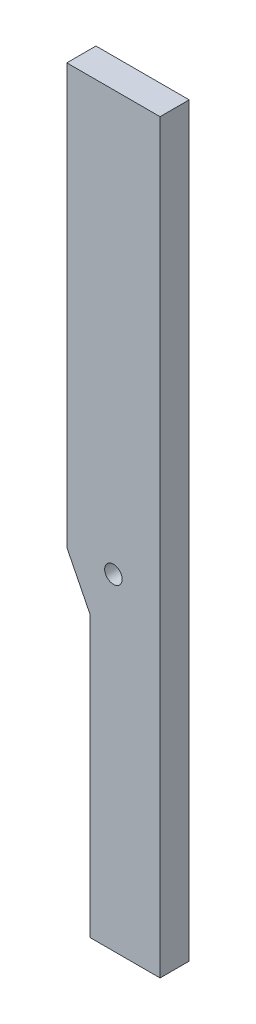
ISO-10303-21;
HEADER;
FILE_DESCRIPTION(('STEP AP214'),'2;1');
FILE_NAME('part.step','',(''),(''),'','','');
FILE_SCHEMA(('AUTOMOTIVE_DESIGN { 1 0 10303 214 1 1 1 1 }'));
ENDSEC;
DATA;
#1=APPLICATION_CONTEXT('core data for automotive mechanical design processes');
#2=APPLICATION_PROTOCOL_DEFINITION('international standard','automotive_design',2000,#1);
#3=PRODUCT_CONTEXT('',#1,'mechanical');
#4=PRODUCT('Part','Part','',(#3));
#5=PRODUCT_RELATED_PRODUCT_CATEGORY('part','',(#4));
#6=PRODUCT_DEFINITION_FORMATION('','',#4);
#7=PRODUCT_DEFINITION_CONTEXT('part definition',#1,'design');
#8=PRODUCT_DEFINITION('design','',#6,#7);
#9=PRODUCT_DEFINITION_SHAPE('','',#8);
#10=(LENGTH_UNIT() NAMED_UNIT(*) SI_UNIT(.MILLI.,.METRE.));
#11=(NAMED_UNIT(*) PLANE_ANGLE_UNIT() SI_UNIT($,.RADIAN.));
#12=(NAMED_UNIT(*) SI_UNIT($,.STERADIAN.) SOLID_ANGLE_UNIT());
#13=UNCERTAINTY_MEASURE_WITH_UNIT(LENGTH_MEASURE(1.E-05),#10,'distance_accuracy_value','');
#14=(GEOMETRIC_REPRESENTATION_CONTEXT(3) GLOBAL_UNCERTAINTY_ASSIGNED_CONTEXT((#13)) GLOBAL_UNIT_ASSIGNED_CONTEXT((#10,
#11,#12)) REPRESENTATION_CONTEXT('',''));
#15=CARTESIAN_POINT('',(0.,0.,0.));
#16=DIRECTION('',(0.,0.,1.));
#17=DIRECTION('',(1.,0.,0.));
#18=AXIS2_PLACEMENT_3D('',#15,#16,#17);
#19=CARTESIAN_POINT('',(0.,0.,15.875));
#20=DIRECTION('',(1.,0.,0.));
#21=DIRECTION('',(0.,0.,-1.));
#22=AXIS2_PLACEMENT_3D('',#19,#20,#21);
#23=PLANE('',#22);
#24=DIRECTION('',(0.,-1.,0.));
#25=VECTOR('',#24,1.);
#26=CARTESIAN_POINT('',(0.,0.,0.));
#27=LINE('',#26,#25);
#28=CARTESIAN_POINT('',(0.,254.,0.));
#29=VERTEX_POINT('',#28);
#30=CARTESIAN_POINT('',(0.,25.4000000000001,0.));
#31=VERTEX_POINT('',#30);
#32=EDGE_CURVE('E118',#29,#31,#27,.T.);
#33=ORIENTED_EDGE('',*,*,#32,.T.);
#34=DIRECTION('',(0.,0.,1.));
#35=VECTOR('',#34,1.);
#36=CARTESIAN_POINT('',(0.,25.4000000000001,15.875));
#37=LINE('',#36,#35);
#38=CARTESIAN_POINT('',(0.,25.4000000000001,15.875));
#39=VERTEX_POINT('',#38);
#40=EDGE_CURVE('E40',#31,#39,#37,.T.);
#41=ORIENTED_EDGE('',*,*,#40,.T.);
#42=DIRECTION('',(0.,-1.,0.));
#43=VECTOR('',#42,1.);
#44=CARTESIAN_POINT('',(0.,0.,15.875));
#45=LINE('',#44,#43);
#46=CARTESIAN_POINT('',(0.,254.,15.875));
#47=VERTEX_POINT('',#46);
#48=EDGE_CURVE('E121',#47,#39,#45,.T.);
#49=ORIENTED_EDGE('',*,*,#48,.F.);
#50=DIRECTION('',(0.,0.,-1.));
#51=VECTOR('',#50,1.);
#52=CARTESIAN_POINT('',(0.,254.,15.875));
#53=LINE('',#52,#51);
#54=EDGE_CURVE('E128',#47,#29,#53,.T.);
#55=ORIENTED_EDGE('',*,*,#54,.T.);
#56=EDGE_LOOP('',(#33,#41,#49,#55));
#57=FACE_BOUND('',#56,.T.);
#58=ADVANCED_FACE('F32',(#57),#23,.F.);
#59=CARTESIAN_POINT('',(50.8,0.,15.875));
#60=DIRECTION('',(-1.,0.,0.));
#61=DIRECTION('',(0.,0.,1.));
#62=AXIS2_PLACEMENT_3D('',#59,#60,#61);
#63=PLANE('',#62);
#64=DIRECTION('',(0.,1.,0.));
#65=VECTOR('',#64,1.);
#66=CARTESIAN_POINT('',(50.8,0.,0.));
#67=LINE('',#66,#65);
#68=CARTESIAN_POINT('',(50.8,-152.4,0.));
#69=VERTEX_POINT('',#68);
#70=CARTESIAN_POINT('',(50.8,254.,0.));
#71=VERTEX_POINT('',#70);
#72=EDGE_CURVE('E102',#69,#71,#67,.T.);
#73=ORIENTED_EDGE('',*,*,#72,.T.);
#74=DIRECTION('',(0.,0.,-1.));
#75=VECTOR('',#74,1.);
#76=CARTESIAN_POINT('',(50.8,254.,15.875));
#77=LINE('',#76,#75);
#78=CARTESIAN_POINT('',(50.8,254.,15.875));
#79=VERTEX_POINT('',#78);
#80=EDGE_CURVE('E134',#79,#71,#77,.T.);
#81=ORIENTED_EDGE('',*,*,#80,.F.);
#82=DIRECTION('',(0.,1.,0.));
#83=VECTOR('',#82,1.);
#84=CARTESIAN_POINT('',(50.8,0.,15.875));
#85=LINE('',#84,#83);
#86=CARTESIAN_POINT('',(50.8,-152.4,15.875));
#87=VERTEX_POINT('',#86);
#88=EDGE_CURVE('E123',#87,#79,#85,.T.);
#89=ORIENTED_EDGE('',*,*,#88,.F.);
#90=DIRECTION('',(0.,0.,1.));
#91=VECTOR('',#90,1.);
#92=CARTESIAN_POINT('',(50.8,-152.4,0.));
#93=LINE('',#92,#91);
#94=EDGE_CURVE('E97',#69,#87,#93,.T.);
#95=ORIENTED_EDGE('',*,*,#94,.F.);
#96=EDGE_LOOP('',(#73,#81,#89,#95));
#97=FACE_BOUND('',#96,.T.);
#98=ADVANCED_FACE('F148',(#97),#63,.F.);
#99=CARTESIAN_POINT('',(0.,254.,15.875));
#100=DIRECTION('',(0.,-1.,0.));
#101=DIRECTION('',(0.,0.,-1.));
#102=AXIS2_PLACEMENT_3D('',#99,#100,#101);
#103=PLANE('',#102);
#104=DIRECTION('',(-1.,0.,0.));
#105=VECTOR('',#104,1.);
#106=CARTESIAN_POINT('',(0.,254.,0.));
#107=LINE('',#106,#105);
#108=EDGE_CURVE('E124',#71,#29,#107,.T.);
#109=ORIENTED_EDGE('',*,*,#108,.T.);
#110=ORIENTED_EDGE('',*,*,#54,.F.);
#111=DIRECTION('',(-1.,0.,0.));
#112=VECTOR('',#111,1.);
#113=CARTESIAN_POINT('',(0.,254.,15.875));
#114=LINE('',#113,#112);
#115=EDGE_CURVE('E126',#79,#47,#114,.T.);
#116=ORIENTED_EDGE('',*,*,#115,.F.);
#117=ORIENTED_EDGE('',*,*,#80,.T.);
#118=EDGE_LOOP('',(#109,#110,#116,#117));
#119=FACE_BOUND('',#118,.T.);
#120=ADVANCED_FACE('F141',(#119),#103,.F.);
#121=CARTESIAN_POINT('',(0.,0.,15.875));
#122=DIRECTION('',(0.,0.,-1.));
#123=DIRECTION('',(-1.,0.,0.));
#124=AXIS2_PLACEMENT_3D('',#121,#122,#123);
#125=PLANE('',#124);
#126=CARTESIAN_POINT('',(25.4,25.4000000000001,15.875));
#127=DIRECTION('',(0.,0.,1.));
#128=DIRECTION('',(1.,0.,0.));
#129=AXIS2_PLACEMENT_3D('',#126,#127,#128);
#130=CIRCLE('',#129,4.7625);
#131=CARTESIAN_POINT('',(30.1625,25.4000000000001,15.875));
#132=VERTEX_POINT('',#131);
#133=EDGE_CURVE('E113',#132,#132,#130,.T.);
#134=ORIENTED_EDGE('',*,*,#133,.F.);
#135=EDGE_LOOP('',(#134));
#136=FACE_BOUND('',#135,.T.);
#137=ORIENTED_EDGE('',*,*,#48,.T.);
#138=DIRECTION('',(-0.447213595499956,0.894427190999917,0.));
#139=VECTOR('',#138,1.);
#140=CARTESIAN_POINT('',(12.7,0.,15.875));
#141=LINE('',#140,#139);
#142=CARTESIAN_POINT('',(12.7,0.,15.875));
#143=VERTEX_POINT('',#142);
#144=EDGE_CURVE('E11',#39,#143,#141,.F.);
#145=ORIENTED_EDGE('',*,*,#144,.T.);
#146=DIRECTION('',(0.,-1.,0.));
#147=VECTOR('',#146,1.);
#148=CARTESIAN_POINT('',(12.7,0.,15.875));
#149=LINE('',#148,#147);
#150=CARTESIAN_POINT('',(12.7,-152.4,15.875));
#151=VERTEX_POINT('',#150);
#152=EDGE_CURVE('E109',#143,#151,#149,.T.);
#153=ORIENTED_EDGE('',*,*,#152,.T.);
#154=DIRECTION('',(1.,0.,0.));
#155=VECTOR('',#154,1.);
#156=CARTESIAN_POINT('',(12.7,-152.4,15.875));
#157=LINE('',#156,#155);
#158=EDGE_CURVE('E93',#151,#87,#157,.T.);
#159=ORIENTED_EDGE('',*,*,#158,.T.);
#160=ORIENTED_EDGE('',*,*,#88,.T.);
#161=ORIENTED_EDGE('',*,*,#115,.T.);
#162=EDGE_LOOP('',(#137,#145,#153,#159,#160,#161));
#163=FACE_BOUND('',#162,.T.);
#164=ADVANCED_FACE('F147',(#136,#163),#125,.F.);
#165=CARTESIAN_POINT('',(0.,0.,0.));
#166=DIRECTION('',(0.,0.,-1.));
#167=DIRECTION('',(-1.,0.,0.));
#168=AXIS2_PLACEMENT_3D('',#165,#166,#167);
#169=PLANE('',#168);
#170=CARTESIAN_POINT('',(25.4,25.4000000000001,0.));
#171=DIRECTION('',(0.,0.,1.));
#172=DIRECTION('',(1.,0.,0.));
#173=AXIS2_PLACEMENT_3D('',#170,#171,#172);
#174=CIRCLE('',#173,4.7625);
#175=CARTESIAN_POINT('',(30.1625,25.4000000000001,0.));
#176=VERTEX_POINT('',#175);
#177=EDGE_CURVE('E115',#176,#176,#174,.T.);
#178=ORIENTED_EDGE('',*,*,#177,.T.);
#179=EDGE_LOOP('',(#178));
#180=FACE_BOUND('',#179,.T.);
#181=ORIENTED_EDGE('',*,*,#72,.F.);
#182=DIRECTION('',(1.,0.,0.));
#183=VECTOR('',#182,1.);
#184=CARTESIAN_POINT('',(12.7,-152.4,0.));
#185=LINE('',#184,#183);
#186=CARTESIAN_POINT('',(12.7,-152.4,0.));
#187=VERTEX_POINT('',#186);
#188=EDGE_CURVE('E91',#187,#69,#185,.T.);
#189=ORIENTED_EDGE('',*,*,#188,.F.);
#190=DIRECTION('',(0.,-1.,0.));
#191=VECTOR('',#190,1.);
#192=CARTESIAN_POINT('',(12.7,0.,0.));
#193=LINE('',#192,#191);
#194=CARTESIAN_POINT('',(12.7,0.,0.));
#195=VERTEX_POINT('',#194);
#196=EDGE_CURVE('E100',#195,#187,#193,.T.);
#197=ORIENTED_EDGE('',*,*,#196,.F.);
#198=DIRECTION('',(0.447213595499956,-0.894427190999917,0.));
#199=VECTOR('',#198,1.);
#200=CARTESIAN_POINT('',(10.16,5.07999999999998,0.));
#201=LINE('',#200,#199);
#202=EDGE_CURVE('E54',#195,#31,#201,.F.);
#203=ORIENTED_EDGE('',*,*,#202,.T.);
#204=ORIENTED_EDGE('',*,*,#32,.F.);
#205=ORIENTED_EDGE('',*,*,#108,.F.);
#206=EDGE_LOOP('',(#181,#189,#197,#203,#204,#205));
#207=FACE_BOUND('',#206,.T.);
#208=ADVANCED_FACE('F99',(#180,#207),#169,.T.);
#209=CARTESIAN_POINT('',(12.7,0.,15.875));
#210=DIRECTION('',(0.894427190999917,0.447213595499956,0.));
#211=DIRECTION('',(0.,0.,-1.));
#212=AXIS2_PLACEMENT_3D('',#209,#210,#211);
#213=PLANE('',#212);
#214=ORIENTED_EDGE('',*,*,#144,.F.);
#215=ORIENTED_EDGE('',*,*,#40,.F.);
#216=ORIENTED_EDGE('',*,*,#202,.F.);
#217=DIRECTION('',(0.,0.,-1.));
#218=VECTOR('',#217,1.);
#219=CARTESIAN_POINT('',(12.7,0.,15.875));
#220=LINE('',#219,#218);
#221=EDGE_CURVE('E107',#143,#195,#220,.T.);
#222=ORIENTED_EDGE('',*,*,#221,.F.);
#223=EDGE_LOOP('',(#214,#215,#216,#222));
#224=FACE_BOUND('',#223,.T.);
#225=ADVANCED_FACE('F34',(#224),#213,.F.);
#226=CARTESIAN_POINT('',(25.4,25.4000000000001,0.));
#227=DIRECTION('',(0.,0.,1.));
#228=DIRECTION('',(1.,0.,0.));
#229=AXIS2_PLACEMENT_3D('',#226,#227,#228);
#230=CYLINDRICAL_SURFACE('',#229,4.7625);
#231=ORIENTED_EDGE('',*,*,#177,.F.);
#232=EDGE_LOOP('',(#231));
#233=FACE_BOUND('',#232,.T.);
#234=ORIENTED_EDGE('',*,*,#133,.T.);
#235=EDGE_LOOP('',(#234));
#236=FACE_BOUND('',#235,.T.);
#237=ADVANCED_FACE('F163',(#233,#236),#230,.F.);
#238=CARTESIAN_POINT('',(12.7,0.,0.));
#239=DIRECTION('',(-1.,0.,0.));
#240=DIRECTION('',(0.,-1.,0.));
#241=AXIS2_PLACEMENT_3D('',#238,#239,#240);
#242=PLANE('',#241);
#243=ORIENTED_EDGE('',*,*,#152,.F.);
#244=ORIENTED_EDGE('',*,*,#221,.T.);
#245=ORIENTED_EDGE('',*,*,#196,.T.);
#246=DIRECTION('',(0.,0.,1.));
#247=VECTOR('',#246,1.);
#248=CARTESIAN_POINT('',(12.7,-152.4,0.));
#249=LINE('',#248,#247);
#250=EDGE_CURVE('E87',#187,#151,#249,.T.);
#251=ORIENTED_EDGE('',*,*,#250,.T.);
#252=EDGE_LOOP('',(#243,#244,#245,#251));
#253=FACE_BOUND('',#252,.T.);
#254=ADVANCED_FACE('F105',(#253),#242,.T.);
#255=CARTESIAN_POINT('',(12.7,-152.4,0.));
#256=DIRECTION('',(0.,-1.,0.));
#257=DIRECTION('',(0.,0.,-1.));
#258=AXIS2_PLACEMENT_3D('',#255,#256,#257);
#259=PLANE('',#258);
#260=ORIENTED_EDGE('',*,*,#158,.F.);
#261=ORIENTED_EDGE('',*,*,#250,.F.);
#262=ORIENTED_EDGE('',*,*,#188,.T.);
#263=ORIENTED_EDGE('',*,*,#94,.T.);
#264=EDGE_LOOP('',(#260,#261,#262,#263));
#265=FACE_BOUND('',#264,.T.);
#266=ADVANCED_FACE('F89',(#265),#259,.T.);
#267=CLOSED_SHELL('',(#58,#98,#120,#164,#208,#225,#237,#254,#266));
#268=MANIFOLD_SOLID_BREP('B2',#267);
#269=ADVANCED_BREP_SHAPE_REPRESENTATION('',(#18,#268),#14);
#270=SHAPE_DEFINITION_REPRESENTATION(#9,#269);
ENDSEC;
END-ISO-10303-21;
